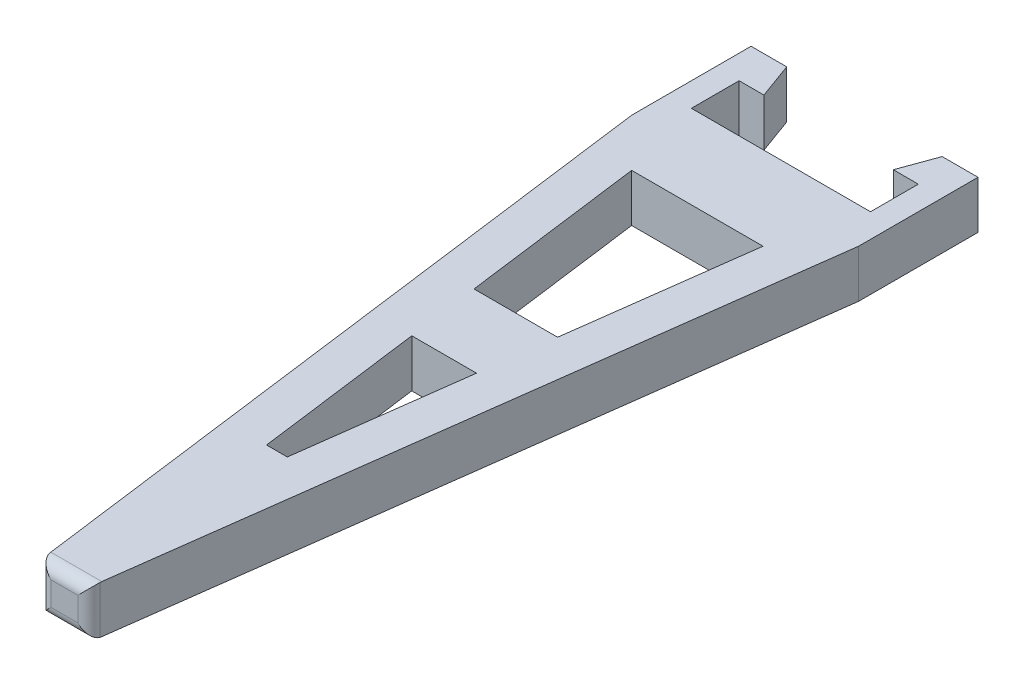
ISO-10303-21;
HEADER;
FILE_DESCRIPTION(('STEP AP214'),'2;1');
FILE_NAME('part.step','',(''),(''),'','','');
FILE_SCHEMA(('AUTOMOTIVE_DESIGN { 1 0 10303 214 1 1 1 1 }'));
ENDSEC;
DATA;
#1=APPLICATION_CONTEXT('core data for automotive mechanical design processes');
#2=APPLICATION_PROTOCOL_DEFINITION('international standard','automotive_design',2000,#1);
#3=PRODUCT_CONTEXT('',#1,'mechanical');
#4=PRODUCT('Part','Part','',(#3));
#5=PRODUCT_RELATED_PRODUCT_CATEGORY('part','',(#4));
#6=PRODUCT_DEFINITION_FORMATION('','',#4);
#7=PRODUCT_DEFINITION_CONTEXT('part definition',#1,'design');
#8=PRODUCT_DEFINITION('design','',#6,#7);
#9=PRODUCT_DEFINITION_SHAPE('','',#8);
#10=(LENGTH_UNIT() NAMED_UNIT(*) SI_UNIT(.MILLI.,.METRE.));
#11=(NAMED_UNIT(*) PLANE_ANGLE_UNIT() SI_UNIT($,.RADIAN.));
#12=(NAMED_UNIT(*) SI_UNIT($,.STERADIAN.) SOLID_ANGLE_UNIT());
#13=UNCERTAINTY_MEASURE_WITH_UNIT(LENGTH_MEASURE(1.E-05),#10,'distance_accuracy_value','');
#14=(GEOMETRIC_REPRESENTATION_CONTEXT(3) GLOBAL_UNCERTAINTY_ASSIGNED_CONTEXT((#13)) GLOBAL_UNIT_ASSIGNED_CONTEXT((#10,
#11,#12)) REPRESENTATION_CONTEXT('',''));
#15=CARTESIAN_POINT('',(0.,0.,0.));
#16=DIRECTION('',(0.,0.,1.));
#17=DIRECTION('',(1.,0.,0.));
#18=AXIS2_PLACEMENT_3D('',#15,#16,#17);
#19=CARTESIAN_POINT('',(0.,4.,0.));
#20=DIRECTION('',(0.,1.,0.));
#21=DIRECTION('',(0.,0.,1.));
#22=AXIS2_PLACEMENT_3D('',#19,#20,#21);
#23=PLANE('',#22);
#24=DIRECTION('',(-1.,0.,0.));
#25=VECTOR('',#24,1.);
#26=CARTESIAN_POINT('',(-3.16599156784221,4.,2.91119108870853));
#27=LINE('',#26,#25);
#28=CARTESIAN_POINT('',(-3.16599156784221,4.,2.91119108870853));
#29=VERTEX_POINT('',#28);
#30=CARTESIAN_POINT('',(-14.1659915678422,4.,2.91119108870852));
#31=VERTEX_POINT('',#30);
#32=EDGE_CURVE('E324',#29,#31,#27,.T.);
#33=ORIENTED_EDGE('',*,*,#32,.F.);
#34=DIRECTION('',(-0.130454512571384,0.,0.991454295542544));
#35=VECTOR('',#34,1.);
#36=CARTESIAN_POINT('',(-3.16599156784221,4.,2.91119108870853));
#37=LINE('',#36,#35);
#38=CARTESIAN_POINT('',(-5.16599156784212,4.,18.1111910887082));
#39=VERTEX_POINT('',#38);
#40=EDGE_CURVE('E310',#29,#39,#37,.T.);
#41=ORIENTED_EDGE('',*,*,#40,.T.);
#42=DIRECTION('',(-1.,0.,0.));
#43=VECTOR('',#42,1.);
#44=CARTESIAN_POINT('',(-5.16599156784212,4.,18.1111910887082));
#45=LINE('',#44,#43);
#46=CARTESIAN_POINT('',(-12.1659915678422,4.,18.1111910887082));
#47=VERTEX_POINT('',#46);
#48=EDGE_CURVE('E318',#39,#47,#45,.T.);
#49=ORIENTED_EDGE('',*,*,#48,.T.);
#50=DIRECTION('',(0.13045451257139,0.,0.991454295542543));
#51=VECTOR('',#50,1.);
#52=CARTESIAN_POINT('',(-14.1659915678422,4.,2.91119108870853));
#53=LINE('',#52,#51);
#54=EDGE_CURVE('E321',#31,#47,#53,.T.);
#55=ORIENTED_EDGE('',*,*,#54,.F.);
#56=EDGE_LOOP('',(#33,#41,#49,#55));
#57=FACE_BOUND('',#56,.T.);
#58=DIRECTION('',(0.13045451257139,0.,0.991454295542543));
#59=VECTOR('',#58,1.);
#60=CARTESIAN_POINT('',(-17.7160096193456,4.,2.33105389728236));
#61=LINE('',#60,#59);
#62=CARTESIAN_POINT('',(-18.1659915678422,4.,-1.08880891129147));
#63=VERTEX_POINT('',#62);
#64=CARTESIAN_POINT('',(-10.7975705152105,4.,54.9111910887085));
#65=VERTEX_POINT('',#64);
#66=EDGE_CURVE('E364',#63,#65,#61,.T.);
#67=ORIENTED_EDGE('',*,*,#66,.T.);
#68=DIRECTION('',(1.,0.,0.));
#69=VECTOR('',#68,1.);
#70=CARTESIAN_POINT('',(-6.66599156784202,4.,54.9111910887085));
#71=LINE('',#70,#69);
#72=CARTESIAN_POINT('',(-6.5344126204736,4.,54.9111910887085));
#73=VERTEX_POINT('',#72);
#74=EDGE_CURVE('E448',#65,#73,#71,.T.);
#75=ORIENTED_EDGE('',*,*,#74,.T.);
#76=DIRECTION('',(0.130454512571384,0.,-0.991454295542544));
#77=VECTOR('',#76,1.);
#78=CARTESIAN_POINT('',(0.678988756222249,4.,0.0893406258187148));
#79=LINE('',#78,#77);
#80=CARTESIAN_POINT('',(0.834008432157797,4.,-1.08880891129147));
#81=VERTEX_POINT('',#80);
#82=EDGE_CURVE('E335',#73,#81,#79,.T.);
#83=ORIENTED_EDGE('',*,*,#82,.T.);
#84=DIRECTION('',(0.,0.,1.));
#85=VECTOR('',#84,1.);
#86=CARTESIAN_POINT('',(0.8340084321578,4.,0.));
#87=LINE('',#86,#85);
#88=CARTESIAN_POINT('',(0.834008432157787,4.,-11.0888089112915));
#89=VERTEX_POINT('',#88);
#90=EDGE_CURVE('E337',#89,#81,#87,.T.);
#91=ORIENTED_EDGE('',*,*,#90,.F.);
#92=DIRECTION('',(1.,0.,0.));
#93=VECTOR('',#92,1.);
#94=CARTESIAN_POINT('',(0.,4.,-11.0888089112915));
#95=LINE('',#94,#93);
#96=CARTESIAN_POINT('',(-2.1659915678422,4.,-11.0888089112915));
#97=VERTEX_POINT('',#96);
#98=EDGE_CURVE('E341',#97,#89,#95,.T.);
#99=ORIENTED_EDGE('',*,*,#98,.F.);
#100=DIRECTION('',(-0.342020143325672,0.,0.939692620785907));
#101=VECTOR('',#100,1.);
#102=CARTESIAN_POINT('',(-2.1659915678422,4.,-11.0888089112915));
#103=LINE('',#102,#101);
#104=CARTESIAN_POINT('',(-3.25790227064081,4.,-8.08880891129147));
#105=VERTEX_POINT('',#104);
#106=EDGE_CURVE('E426',#97,#105,#103,.T.);
#107=ORIENTED_EDGE('',*,*,#106,.T.);
#108=DIRECTION('',(1.,0.,0.));
#109=VECTOR('',#108,1.);
#110=CARTESIAN_POINT('',(0.,4.,-8.08880891129147));
#111=LINE('',#110,#109);
#112=CARTESIAN_POINT('',(-1.16599156784221,4.,-8.08880891129147));
#113=VERTEX_POINT('',#112);
#114=EDGE_CURVE('E344',#105,#113,#111,.T.);
#115=ORIENTED_EDGE('',*,*,#114,.T.);
#116=DIRECTION('',(0.,0.,1.));
#117=VECTOR('',#116,1.);
#118=CARTESIAN_POINT('',(-1.16599156784221,4.,0.));
#119=LINE('',#118,#117);
#120=CARTESIAN_POINT('',(-1.16599156784221,4.,-4.08880891129147));
#121=VERTEX_POINT('',#120);
#122=EDGE_CURVE('E346',#113,#121,#119,.T.);
#123=ORIENTED_EDGE('',*,*,#122,.T.);
#124=DIRECTION('',(1.,0.,0.));
#125=VECTOR('',#124,1.);
#126=CARTESIAN_POINT('',(0.,4.,-4.08880891129147));
#127=LINE('',#126,#125);
#128=CARTESIAN_POINT('',(-16.1659915678422,4.,-4.08880891129147));
#129=VERTEX_POINT('',#128);
#130=EDGE_CURVE('E348',#129,#121,#127,.T.);
#131=ORIENTED_EDGE('',*,*,#130,.F.);
#132=DIRECTION('',(0.,0.,1.));
#133=VECTOR('',#132,1.);
#134=CARTESIAN_POINT('',(-16.1659915678422,4.,0.));
#135=LINE('',#134,#133);
#136=CARTESIAN_POINT('',(-16.1659915678422,4.,-8.08880891129148));
#137=VERTEX_POINT('',#136);
#138=EDGE_CURVE('E351',#137,#129,#135,.T.);
#139=ORIENTED_EDGE('',*,*,#138,.F.);
#140=DIRECTION('',(1.,0.,0.));
#141=VECTOR('',#140,1.);
#142=CARTESIAN_POINT('',(0.,4.,-8.08880891129147));
#143=LINE('',#142,#141);
#144=CARTESIAN_POINT('',(-14.0896605657909,4.,-8.08880891129147));
#145=VERTEX_POINT('',#144);
#146=EDGE_CURVE('E354',#137,#145,#143,.T.);
#147=ORIENTED_EDGE('',*,*,#146,.T.);
#148=DIRECTION('',(0.342020143325666,0.,0.93969262078591));
#149=VECTOR('',#148,1.);
#150=CARTESIAN_POINT('',(-9.84179030117375,4.,3.58211872151701));
#151=LINE('',#150,#149);
#152=CARTESIAN_POINT('',(-15.1815712685895,4.,-11.0888089112915));
#153=VERTEX_POINT('',#152);
#154=EDGE_CURVE('E356',#153,#145,#151,.T.);
#155=ORIENTED_EDGE('',*,*,#154,.F.);
#156=DIRECTION('',(1.,0.,0.));
#157=VECTOR('',#156,1.);
#158=CARTESIAN_POINT('',(0.,4.,-11.0888089112915));
#159=LINE('',#158,#157);
#160=CARTESIAN_POINT('',(-18.1659915678422,4.,-11.0888089112915));
#161=VERTEX_POINT('',#160);
#162=EDGE_CURVE('E359',#161,#153,#159,.T.);
#163=ORIENTED_EDGE('',*,*,#162,.F.);
#164=DIRECTION('',(0.,0.,1.));
#165=VECTOR('',#164,1.);
#166=CARTESIAN_POINT('',(-18.1659915678422,4.,0.));
#167=LINE('',#166,#165);
#168=EDGE_CURVE('E362',#161,#63,#167,.T.);
#169=ORIENTED_EDGE('',*,*,#168,.T.);
#170=EDGE_LOOP('',(#67,#75,#83,#91,#99,#107,#115,#123,#131,#139,#147,#155,#163,#169));
#171=FACE_BOUND('',#170,.T.);
#172=DIRECTION('',(-0.130454512571384,0.,0.991454295542544));
#173=VECTOR('',#172,1.);
#174=CARTESIAN_POINT('',(-2.73557897692958,4.,-0.359944602227568));
#175=LINE('',#174,#173);
#176=CARTESIAN_POINT('',(-5.95546525205263,4.,24.1111910887082));
#177=VERTEX_POINT('',#176);
#178=CARTESIAN_POINT('',(-7.79757051521048,4.,38.1111910887082));
#179=VERTEX_POINT('',#178);
#180=EDGE_CURVE('E287',#177,#179,#175,.T.);
#181=ORIENTED_EDGE('',*,*,#180,.T.);
#182=DIRECTION('',(-1.,0.,0.));
#183=VECTOR('',#182,1.);
#184=CARTESIAN_POINT('',(0.,4.,38.1111910887082));
#185=LINE('',#184,#183);
#186=CARTESIAN_POINT('',(-9.53441262047371,4.,38.1111910887082));
#187=VERTEX_POINT('',#186);
#188=EDGE_CURVE('E280',#179,#187,#185,.T.);
#189=ORIENTED_EDGE('',*,*,#188,.T.);
#190=DIRECTION('',(0.13045451257139,0.,0.991454295542543));
#191=VECTOR('',#190,1.);
#192=CARTESIAN_POINT('',(-14.3014418861938,4.,1.88176866923607));
#193=LINE('',#192,#191);
#194=CARTESIAN_POINT('',(-11.3765178836316,4.,24.1111910887082));
#195=VERTEX_POINT('',#194);
#196=EDGE_CURVE('E281',#195,#187,#193,.T.);
#197=ORIENTED_EDGE('',*,*,#196,.F.);
#198=DIRECTION('',(-1.,0.,0.));
#199=VECTOR('',#198,1.);
#200=CARTESIAN_POINT('',(0.,4.,24.1111910887082));
#201=LINE('',#200,#199);
#202=EDGE_CURVE('E294',#177,#195,#201,.T.);
#203=ORIENTED_EDGE('',*,*,#202,.F.);
#204=EDGE_LOOP('',(#181,#189,#197,#203));
#205=FACE_BOUND('',#204,.T.);
#206=ADVANCED_FACE('F89',(#57,#171,#205),#23,.T.);
#207=CARTESIAN_POINT('',(0.,0.,0.));
#208=DIRECTION('',(0.,1.,0.));
#209=DIRECTION('',(0.,0.,1.));
#210=AXIS2_PLACEMENT_3D('',#207,#208,#209);
#211=PLANE('',#210);
#212=DIRECTION('',(0.130454512571384,0.,-0.991454295542544));
#213=VECTOR('',#212,1.);
#214=CARTESIAN_POINT('',(0.678988756222249,0.,0.0893406258187148));
#215=LINE('',#214,#213);
#216=CARTESIAN_POINT('',(-6.5344126204736,0.,54.9111910887085));
#217=VERTEX_POINT('',#216);
#218=CARTESIAN_POINT('',(0.834008432157797,0.,-1.08880891129147));
#219=VERTEX_POINT('',#218);
#220=EDGE_CURVE('E368',#217,#219,#215,.T.);
#221=ORIENTED_EDGE('',*,*,#220,.F.);
#222=DIRECTION('',(1.,0.,0.));
#223=VECTOR('',#222,1.);
#224=CARTESIAN_POINT('',(0.,0.,54.9111910887085));
#225=LINE('',#224,#223);
#226=CARTESIAN_POINT('',(-10.7975705152105,0.,54.9111910887085));
#227=VERTEX_POINT('',#226);
#228=EDGE_CURVE('E12',#217,#227,#225,.F.);
#229=ORIENTED_EDGE('',*,*,#228,.T.);
#230=DIRECTION('',(0.13045451257139,0.,0.991454295542543));
#231=VECTOR('',#230,1.);
#232=CARTESIAN_POINT('',(-17.7160096193456,0.,2.33105389728236));
#233=LINE('',#232,#231);
#234=CARTESIAN_POINT('',(-18.1659915678422,0.,-1.08880891129147));
#235=VERTEX_POINT('',#234);
#236=EDGE_CURVE('E338',#235,#227,#233,.T.);
#237=ORIENTED_EDGE('',*,*,#236,.F.);
#238=DIRECTION('',(0.,0.,1.));
#239=VECTOR('',#238,1.);
#240=CARTESIAN_POINT('',(-18.1659915678422,0.,0.));
#241=LINE('',#240,#239);
#242=CARTESIAN_POINT('',(-18.1659915678422,0.,-11.0888089112915));
#243=VERTEX_POINT('',#242);
#244=EDGE_CURVE('E397',#243,#235,#241,.T.);
#245=ORIENTED_EDGE('',*,*,#244,.F.);
#246=DIRECTION('',(1.,0.,0.));
#247=VECTOR('',#246,1.);
#248=CARTESIAN_POINT('',(0.,0.,-11.0888089112915));
#249=LINE('',#248,#247);
#250=CARTESIAN_POINT('',(-15.1815712685895,0.,-11.0888089112915));
#251=VERTEX_POINT('',#250);
#252=EDGE_CURVE('E394',#243,#251,#249,.T.);
#253=ORIENTED_EDGE('',*,*,#252,.T.);
#254=DIRECTION('',(0.342020143325666,0.,0.93969262078591));
#255=VECTOR('',#254,1.);
#256=CARTESIAN_POINT('',(-9.84179030117375,0.,3.58211872151701));
#257=LINE('',#256,#255);
#258=CARTESIAN_POINT('',(-14.0896605657909,0.,-8.08880891129147));
#259=VERTEX_POINT('',#258);
#260=EDGE_CURVE('E391',#251,#259,#257,.T.);
#261=ORIENTED_EDGE('',*,*,#260,.T.);
#262=DIRECTION('',(1.,0.,0.));
#263=VECTOR('',#262,1.);
#264=CARTESIAN_POINT('',(0.,0.,-8.08880891129147));
#265=LINE('',#264,#263);
#266=CARTESIAN_POINT('',(-16.1659915678422,0.,-8.08880891129148));
#267=VERTEX_POINT('',#266);
#268=EDGE_CURVE('E388',#267,#259,#265,.T.);
#269=ORIENTED_EDGE('',*,*,#268,.F.);
#270=DIRECTION('',(0.,0.,1.));
#271=VECTOR('',#270,1.);
#272=CARTESIAN_POINT('',(-16.1659915678422,0.,0.));
#273=LINE('',#272,#271);
#274=CARTESIAN_POINT('',(-16.1659915678422,0.,-4.08880891129147));
#275=VERTEX_POINT('',#274);
#276=EDGE_CURVE('E385',#267,#275,#273,.T.);
#277=ORIENTED_EDGE('',*,*,#276,.T.);
#278=DIRECTION('',(1.,0.,0.));
#279=VECTOR('',#278,1.);
#280=CARTESIAN_POINT('',(0.,0.,-4.08880891129147));
#281=LINE('',#280,#279);
#282=CARTESIAN_POINT('',(-1.16599156784221,0.,-4.08880891129147));
#283=VERTEX_POINT('',#282);
#284=EDGE_CURVE('E382',#275,#283,#281,.T.);
#285=ORIENTED_EDGE('',*,*,#284,.T.);
#286=DIRECTION('',(0.,0.,1.));
#287=VECTOR('',#286,1.);
#288=CARTESIAN_POINT('',(-1.16599156784221,0.,0.));
#289=LINE('',#288,#287);
#290=CARTESIAN_POINT('',(-1.16599156784221,0.,-8.08880891129147));
#291=VERTEX_POINT('',#290);
#292=EDGE_CURVE('E379',#291,#283,#289,.T.);
#293=ORIENTED_EDGE('',*,*,#292,.F.);
#294=DIRECTION('',(1.,0.,0.));
#295=VECTOR('',#294,1.);
#296=CARTESIAN_POINT('',(0.,0.,-8.08880891129147));
#297=LINE('',#296,#295);
#298=CARTESIAN_POINT('',(-3.25790227064081,0.,-8.08880891129147));
#299=VERTEX_POINT('',#298);
#300=EDGE_CURVE('E377',#299,#291,#297,.T.);
#301=ORIENTED_EDGE('',*,*,#300,.F.);
#302=DIRECTION('',(-0.342020143325672,0.,0.939692620785907));
#303=VECTOR('',#302,1.);
#304=CARTESIAN_POINT('',(-2.1659915678422,0.,-11.0888089112915));
#305=LINE('',#304,#303);
#306=CARTESIAN_POINT('',(-2.1659915678422,0.,-11.0888089112915));
#307=VERTEX_POINT('',#306);
#308=EDGE_CURVE('E272',#307,#299,#305,.T.);
#309=ORIENTED_EDGE('',*,*,#308,.F.);
#310=DIRECTION('',(1.,0.,0.));
#311=VECTOR('',#310,1.);
#312=CARTESIAN_POINT('',(0.,0.,-11.0888089112915));
#313=LINE('',#312,#311);
#314=CARTESIAN_POINT('',(0.834008432157787,0.,-11.0888089112915));
#315=VERTEX_POINT('',#314);
#316=EDGE_CURVE('E374',#307,#315,#313,.T.);
#317=ORIENTED_EDGE('',*,*,#316,.T.);
#318=DIRECTION('',(0.,0.,1.));
#319=VECTOR('',#318,1.);
#320=CARTESIAN_POINT('',(0.8340084321578,0.,0.));
#321=LINE('',#320,#319);
#322=EDGE_CURVE('E370',#315,#219,#321,.T.);
#323=ORIENTED_EDGE('',*,*,#322,.T.);
#324=EDGE_LOOP('',(#221,#229,#237,#245,#253,#261,#269,#277,#285,#293,#301,#309,#317,#323));
#325=FACE_BOUND('',#324,.T.);
#326=DIRECTION('',(0.130454512571384,0.,-0.991454295542544));
#327=VECTOR('',#326,1.);
#328=CARTESIAN_POINT('',(-3.16599156784221,0.,2.91119108870853));
#329=LINE('',#328,#327);
#330=CARTESIAN_POINT('',(-5.16599156784212,0.,18.1111910887082));
#331=VERTEX_POINT('',#330);
#332=CARTESIAN_POINT('',(-3.16599156784221,0.,2.91119108870853));
#333=VERTEX_POINT('',#332);
#334=EDGE_CURVE('E329',#331,#333,#329,.T.);
#335=ORIENTED_EDGE('',*,*,#334,.T.);
#336=DIRECTION('',(1.,0.,0.));
#337=VECTOR('',#336,1.);
#338=CARTESIAN_POINT('',(-3.16599156784221,0.,2.91119108870853));
#339=LINE('',#338,#337);
#340=CARTESIAN_POINT('',(-14.1659915678422,0.,2.91119108870853));
#341=VERTEX_POINT('',#340);
#342=EDGE_CURVE('E326',#341,#333,#339,.T.);
#343=ORIENTED_EDGE('',*,*,#342,.F.);
#344=DIRECTION('',(-0.13045451257139,0.,-0.991454295542543));
#345=VECTOR('',#344,1.);
#346=CARTESIAN_POINT('',(-14.1659915678422,0.,2.91119108870853));
#347=LINE('',#346,#345);
#348=CARTESIAN_POINT('',(-12.1659915678422,0.,18.1111910887082));
#349=VERTEX_POINT('',#348);
#350=EDGE_CURVE('E303',#349,#341,#347,.T.);
#351=ORIENTED_EDGE('',*,*,#350,.F.);
#352=DIRECTION('',(1.,0.,0.));
#353=VECTOR('',#352,1.);
#354=CARTESIAN_POINT('',(-5.16599156784212,0.,18.1111910887082));
#355=LINE('',#354,#353);
#356=EDGE_CURVE('E332',#349,#331,#355,.T.);
#357=ORIENTED_EDGE('',*,*,#356,.T.);
#358=EDGE_LOOP('',(#335,#343,#351,#357));
#359=FACE_BOUND('',#358,.T.);
#360=DIRECTION('',(1.,0.,0.));
#361=VECTOR('',#360,1.);
#362=CARTESIAN_POINT('',(0.,0.,38.1111910887082));
#363=LINE('',#362,#361);
#364=CARTESIAN_POINT('',(-9.53441262047371,0.,38.1111910887082));
#365=VERTEX_POINT('',#364);
#366=CARTESIAN_POINT('',(-7.79757051521048,0.,38.1111910887082));
#367=VERTEX_POINT('',#366);
#368=EDGE_CURVE('E277',#365,#367,#363,.T.);
#369=ORIENTED_EDGE('',*,*,#368,.T.);
#370=DIRECTION('',(0.130454512571384,0.,-0.991454295542544));
#371=VECTOR('',#370,1.);
#372=CARTESIAN_POINT('',(-2.73557897692958,0.,-0.359944602227568));
#373=LINE('',#372,#371);
#374=CARTESIAN_POINT('',(-5.95546525205263,0.,24.1111910887082));
#375=VERTEX_POINT('',#374);
#376=EDGE_CURVE('E261',#367,#375,#373,.T.);
#377=ORIENTED_EDGE('',*,*,#376,.T.);
#378=DIRECTION('',(1.,0.,0.));
#379=VECTOR('',#378,1.);
#380=CARTESIAN_POINT('',(0.,0.,24.1111910887082));
#381=LINE('',#380,#379);
#382=CARTESIAN_POINT('',(-11.3765178836316,0.,24.1111910887082));
#383=VERTEX_POINT('',#382);
#384=EDGE_CURVE('E289',#383,#375,#381,.T.);
#385=ORIENTED_EDGE('',*,*,#384,.F.);
#386=DIRECTION('',(-0.13045451257139,0.,-0.991454295542543));
#387=VECTOR('',#386,1.);
#388=CARTESIAN_POINT('',(-14.3014418861938,0.,1.88176866923607));
#389=LINE('',#388,#387);
#390=EDGE_CURVE('E285',#365,#383,#389,.T.);
#391=ORIENTED_EDGE('',*,*,#390,.F.);
#392=EDGE_LOOP('',(#369,#377,#385,#391));
#393=FACE_BOUND('',#392,.T.);
#394=ADVANCED_FACE('F284',(#325,#359,#393),#211,.F.);
#395=CARTESIAN_POINT('',(0.,4.,55.9111910887085));
#396=DIRECTION('',(0.,0.,-1.));
#397=DIRECTION('',(-1.,0.,0.));
#398=AXIS2_PLACEMENT_3D('',#395,#396,#397);
#399=PLANE('',#398);
#400=DIRECTION('',(1.,0.,0.));
#401=VECTOR('',#400,1.);
#402=CARTESIAN_POINT('',(-10.665991567842,3.,55.9111910887085));
#403=LINE('',#402,#401);
#404=CARTESIAN_POINT('',(-7.54303198345975,3.,55.9111910887085));
#405=VERTEX_POINT('',#404);
#406=CARTESIAN_POINT('',(-9.7889511522243,3.,55.9111910887085));
#407=VERTEX_POINT('',#406);
#408=EDGE_CURVE('E436',#405,#407,#403,.F.);
#409=ORIENTED_EDGE('',*,*,#408,.T.);
#410=DIRECTION('',(0.,-1.,0.));
#411=VECTOR('',#410,1.);
#412=CARTESIAN_POINT('',(-9.7889511522243,4.,55.9111910887085));
#413=LINE('',#412,#411);
#414=CARTESIAN_POINT('',(-9.7889511522243,1.,55.9111910887085));
#415=VERTEX_POINT('',#414);
#416=EDGE_CURVE('E438',#407,#415,#413,.T.);
#417=ORIENTED_EDGE('',*,*,#416,.T.);
#418=DIRECTION('',(1.,0.,0.));
#419=VECTOR('',#418,1.);
#420=CARTESIAN_POINT('',(0.,1.,55.9111910887085));
#421=LINE('',#420,#419);
#422=CARTESIAN_POINT('',(-7.54303198345975,1.,55.9111910887085));
#423=VERTEX_POINT('',#422);
#424=EDGE_CURVE('E425',#415,#423,#421,.T.);
#425=ORIENTED_EDGE('',*,*,#424,.T.);
#426=DIRECTION('',(0.,-1.,0.));
#427=VECTOR('',#426,1.);
#428=CARTESIAN_POINT('',(-7.54303198345975,4.,55.9111910887085));
#429=LINE('',#428,#427);
#430=EDGE_CURVE('E434',#423,#405,#429,.F.);
#431=ORIENTED_EDGE('',*,*,#430,.T.);
#432=EDGE_LOOP('',(#409,#417,#425,#431));
#433=FACE_BOUND('',#432,.T.);
#434=ADVANCED_FACE('F499',(#433),#399,.F.);
#435=CARTESIAN_POINT('',(0.678988756222249,4.,0.0893406258187148));
#436=DIRECTION('',(-0.991454295542544,0.,-0.130454512571384));
#437=DIRECTION('',(-0.130454512571384,0.,0.991454295542544));
#438=AXIS2_PLACEMENT_3D('',#435,#436,#437);
#439=PLANE('',#438);
#440=ORIENTED_EDGE('',*,*,#82,.F.);
#441=CARTESIAN_POINT('',(-6.5344126204736,3.,54.9111910887085));
#442=DIRECTION('',(-0.991454295542544,0.,-0.130454512571384));
#443=DIRECTION('',(-0.130454512571384,0.,0.991454295542544));
#444=AXIS2_PLACEMENT_3D('',#441,#442,#443);
#445=ELLIPSE('',#444,1.00861936298615,1.);
#446=CARTESIAN_POINT('',(-6.5515776879172,3.99145429554255,55.0416456012799));
#447=VERTEX_POINT('',#446);
#448=EDGE_CURVE('E98',#73,#447,#445,.F.);
#449=ORIENTED_EDGE('',*,*,#448,.T.);
#450=DIRECTION('',(0.,-1.,0.));
#451=VECTOR('',#450,1.);
#452=CARTESIAN_POINT('',(-6.5515776879172,4.,55.0416456012799));
#453=LINE('',#452,#451);
#454=CARTESIAN_POINT('',(-6.5515776879172,0.008545704457452,55.0416456012799));
#455=VERTEX_POINT('',#454);
#456=EDGE_CURVE('E109',#447,#455,#453,.T.);
#457=ORIENTED_EDGE('',*,*,#456,.T.);
#458=CARTESIAN_POINT('',(-6.5344126204736,1.,54.9111910887085));
#459=DIRECTION('',(-0.991454295542544,0.,-0.130454512571384));
#460=DIRECTION('',(0.130454512571384,0.,-0.991454295542544));
#461=AXIS2_PLACEMENT_3D('',#458,#459,#460);
#462=ELLIPSE('',#461,1.00861936298615,1.);
#463=EDGE_CURVE('E450',#455,#217,#462,.F.);
#464=ORIENTED_EDGE('',*,*,#463,.T.);
#465=ORIENTED_EDGE('',*,*,#220,.T.);
#466=DIRECTION('',(0.,-1.,0.));
#467=VECTOR('',#466,1.);
#468=CARTESIAN_POINT('',(0.834008432157797,4.,-1.08880891129147));
#469=LINE('',#468,#467);
#470=EDGE_CURVE('E422',#81,#219,#469,.T.);
#471=ORIENTED_EDGE('',*,*,#470,.F.);
#472=EDGE_LOOP('',(#440,#449,#457,#464,#465,#471));
#473=FACE_BOUND('',#472,.T.);
#474=ADVANCED_FACE('F475',(#473),#439,.F.);
#475=CARTESIAN_POINT('',(0.8340084321578,4.,0.));
#476=DIRECTION('',(1.,0.,0.));
#477=DIRECTION('',(0.,0.,-1.));
#478=AXIS2_PLACEMENT_3D('',#475,#476,#477);
#479=PLANE('',#478);
#480=ORIENTED_EDGE('',*,*,#322,.F.);
#481=DIRECTION('',(0.,-1.,0.));
#482=VECTOR('',#481,1.);
#483=CARTESIAN_POINT('',(0.834008432157787,4.,-11.0888089112915));
#484=LINE('',#483,#482);
#485=EDGE_CURVE('E420',#89,#315,#484,.T.);
#486=ORIENTED_EDGE('',*,*,#485,.F.);
#487=ORIENTED_EDGE('',*,*,#90,.T.);
#488=ORIENTED_EDGE('',*,*,#470,.T.);
#489=EDGE_LOOP('',(#480,#486,#487,#488));
#490=FACE_BOUND('',#489,.T.);
#491=ADVANCED_FACE('F484',(#490),#479,.T.);
#492=CARTESIAN_POINT('',(0.,4.,-11.0888089112915));
#493=DIRECTION('',(0.,0.,-1.));
#494=DIRECTION('',(-1.,0.,0.));
#495=AXIS2_PLACEMENT_3D('',#492,#493,#494);
#496=PLANE('',#495);
#497=ORIENTED_EDGE('',*,*,#316,.F.);
#498=DIRECTION('',(0.,-1.,0.));
#499=VECTOR('',#498,1.);
#500=CARTESIAN_POINT('',(-2.1659915678422,4.,-11.0888089112915));
#501=LINE('',#500,#499);
#502=EDGE_CURVE('E418',#97,#307,#501,.T.);
#503=ORIENTED_EDGE('',*,*,#502,.F.);
#504=ORIENTED_EDGE('',*,*,#98,.T.);
#505=ORIENTED_EDGE('',*,*,#485,.T.);
#506=EDGE_LOOP('',(#497,#503,#504,#505));
#507=FACE_BOUND('',#506,.T.);
#508=ADVANCED_FACE('F556',(#507),#496,.T.);
#509=CARTESIAN_POINT('',(0.,4.,-8.08880891129147));
#510=DIRECTION('',(0.,0.,-1.));
#511=DIRECTION('',(-1.,0.,0.));
#512=AXIS2_PLACEMENT_3D('',#509,#510,#511);
#513=PLANE('',#512);
#514=ORIENTED_EDGE('',*,*,#300,.T.);
#515=DIRECTION('',(0.,-1.,0.));
#516=VECTOR('',#515,1.);
#517=CARTESIAN_POINT('',(-1.16599156784221,4.,-8.08880891129147));
#518=LINE('',#517,#516);
#519=EDGE_CURVE('E415',#113,#291,#518,.T.);
#520=ORIENTED_EDGE('',*,*,#519,.F.);
#521=ORIENTED_EDGE('',*,*,#114,.F.);
#522=DIRECTION('',(0.,-1.,0.));
#523=VECTOR('',#522,1.);
#524=CARTESIAN_POINT('',(-3.25790227064081,4.,-8.08880891129147));
#525=LINE('',#524,#523);
#526=EDGE_CURVE('E371',#105,#299,#525,.T.);
#527=ORIENTED_EDGE('',*,*,#526,.T.);
#528=EDGE_LOOP('',(#514,#520,#521,#527));
#529=FACE_BOUND('',#528,.T.);
#530=ADVANCED_FACE('F552',(#529),#513,.F.);
#531=CARTESIAN_POINT('',(-1.16599156784221,4.,0.));
#532=DIRECTION('',(1.,0.,0.));
#533=DIRECTION('',(0.,0.,-1.));
#534=AXIS2_PLACEMENT_3D('',#531,#532,#533);
#535=PLANE('',#534);
#536=ORIENTED_EDGE('',*,*,#292,.T.);
#537=DIRECTION('',(0.,-1.,0.));
#538=VECTOR('',#537,1.);
#539=CARTESIAN_POINT('',(-1.16599156784221,4.,-4.08880891129147));
#540=LINE('',#539,#538);
#541=EDGE_CURVE('E413',#121,#283,#540,.T.);
#542=ORIENTED_EDGE('',*,*,#541,.F.);
#543=ORIENTED_EDGE('',*,*,#122,.F.);
#544=ORIENTED_EDGE('',*,*,#519,.T.);
#545=EDGE_LOOP('',(#536,#542,#543,#544));
#546=FACE_BOUND('',#545,.T.);
#547=ADVANCED_FACE('F548',(#546),#535,.F.);
#548=CARTESIAN_POINT('',(0.,4.,-4.08880891129147));
#549=DIRECTION('',(0.,0.,-1.));
#550=DIRECTION('',(-1.,0.,0.));
#551=AXIS2_PLACEMENT_3D('',#548,#549,#550);
#552=PLANE('',#551);
#553=ORIENTED_EDGE('',*,*,#284,.F.);
#554=DIRECTION('',(0.,-1.,0.));
#555=VECTOR('',#554,1.);
#556=CARTESIAN_POINT('',(-16.1659915678422,4.,-4.08880891129147));
#557=LINE('',#556,#555);
#558=EDGE_CURVE('E411',#129,#275,#557,.T.);
#559=ORIENTED_EDGE('',*,*,#558,.F.);
#560=ORIENTED_EDGE('',*,*,#130,.T.);
#561=ORIENTED_EDGE('',*,*,#541,.T.);
#562=EDGE_LOOP('',(#553,#559,#560,#561));
#563=FACE_BOUND('',#562,.T.);
#564=ADVANCED_FACE('F544',(#563),#552,.T.);
#565=CARTESIAN_POINT('',(-16.1659915678422,4.,0.));
#566=DIRECTION('',(1.,0.,0.));
#567=DIRECTION('',(0.,0.,-1.));
#568=AXIS2_PLACEMENT_3D('',#565,#566,#567);
#569=PLANE('',#568);
#570=ORIENTED_EDGE('',*,*,#276,.F.);
#571=DIRECTION('',(0.,-1.,0.));
#572=VECTOR('',#571,1.);
#573=CARTESIAN_POINT('',(-16.1659915678422,4.,-8.08880891129148));
#574=LINE('',#573,#572);
#575=EDGE_CURVE('E409',#137,#267,#574,.T.);
#576=ORIENTED_EDGE('',*,*,#575,.F.);
#577=ORIENTED_EDGE('',*,*,#138,.T.);
#578=ORIENTED_EDGE('',*,*,#558,.T.);
#579=EDGE_LOOP('',(#570,#576,#577,#578));
#580=FACE_BOUND('',#579,.T.);
#581=ADVANCED_FACE('F540',(#580),#569,.T.);
#582=CARTESIAN_POINT('',(0.,4.,-8.08880891129147));
#583=DIRECTION('',(0.,0.,-1.));
#584=DIRECTION('',(-1.,0.,0.));
#585=AXIS2_PLACEMENT_3D('',#582,#583,#584);
#586=PLANE('',#585);
#587=ORIENTED_EDGE('',*,*,#268,.T.);
#588=DIRECTION('',(0.,-1.,0.));
#589=VECTOR('',#588,1.);
#590=CARTESIAN_POINT('',(-14.0896605657909,4.,-8.08880891129147));
#591=LINE('',#590,#589);
#592=EDGE_CURVE('E407',#145,#259,#591,.T.);
#593=ORIENTED_EDGE('',*,*,#592,.F.);
#594=ORIENTED_EDGE('',*,*,#146,.F.);
#595=ORIENTED_EDGE('',*,*,#575,.T.);
#596=EDGE_LOOP('',(#587,#593,#594,#595));
#597=FACE_BOUND('',#596,.T.);
#598=ADVANCED_FACE('F536',(#597),#586,.F.);
#599=CARTESIAN_POINT('',(-9.84179030117375,4.,3.58211872151701));
#600=DIRECTION('',(0.93969262078591,0.,-0.342020143325666));
#601=DIRECTION('',(-0.342020143325666,0.,-0.93969262078591));
#602=AXIS2_PLACEMENT_3D('',#599,#600,#601);
#603=PLANE('',#602);
#604=ORIENTED_EDGE('',*,*,#260,.F.);
#605=DIRECTION('',(0.,-1.,0.));
#606=VECTOR('',#605,1.);
#607=CARTESIAN_POINT('',(-15.1815712685895,4.,-11.0888089112915));
#608=LINE('',#607,#606);
#609=EDGE_CURVE('E405',#153,#251,#608,.T.);
#610=ORIENTED_EDGE('',*,*,#609,.F.);
#611=ORIENTED_EDGE('',*,*,#154,.T.);
#612=ORIENTED_EDGE('',*,*,#592,.T.);
#613=EDGE_LOOP('',(#604,#610,#611,#612));
#614=FACE_BOUND('',#613,.T.);
#615=ADVANCED_FACE('F532',(#614),#603,.T.);
#616=CARTESIAN_POINT('',(0.,4.,-11.0888089112915));
#617=DIRECTION('',(0.,0.,-1.));
#618=DIRECTION('',(-1.,0.,0.));
#619=AXIS2_PLACEMENT_3D('',#616,#617,#618);
#620=PLANE('',#619);
#621=ORIENTED_EDGE('',*,*,#252,.F.);
#622=DIRECTION('',(0.,-1.,0.));
#623=VECTOR('',#622,1.);
#624=CARTESIAN_POINT('',(-18.1659915678422,4.,-11.0888089112915));
#625=LINE('',#624,#623);
#626=EDGE_CURVE('E403',#161,#243,#625,.T.);
#627=ORIENTED_EDGE('',*,*,#626,.F.);
#628=ORIENTED_EDGE('',*,*,#162,.T.);
#629=ORIENTED_EDGE('',*,*,#609,.T.);
#630=EDGE_LOOP('',(#621,#627,#628,#629));
#631=FACE_BOUND('',#630,.T.);
#632=ADVANCED_FACE('F528',(#631),#620,.T.);
#633=CARTESIAN_POINT('',(-18.1659915678422,4.,0.));
#634=DIRECTION('',(1.,0.,0.));
#635=DIRECTION('',(0.,0.,-1.));
#636=AXIS2_PLACEMENT_3D('',#633,#634,#635);
#637=PLANE('',#636);
#638=ORIENTED_EDGE('',*,*,#244,.T.);
#639=DIRECTION('',(0.,-1.,0.));
#640=VECTOR('',#639,1.);
#641=CARTESIAN_POINT('',(-18.1659915678422,4.,-1.08880891129147));
#642=LINE('',#641,#640);
#643=EDGE_CURVE('E367',#63,#235,#642,.T.);
#644=ORIENTED_EDGE('',*,*,#643,.F.);
#645=ORIENTED_EDGE('',*,*,#168,.F.);
#646=ORIENTED_EDGE('',*,*,#626,.T.);
#647=EDGE_LOOP('',(#638,#644,#645,#646));
#648=FACE_BOUND('',#647,.T.);
#649=ADVANCED_FACE('F525',(#648),#637,.F.);
#650=CARTESIAN_POINT('',(-17.7160096193456,4.,2.33105389728236));
#651=DIRECTION('',(0.991454295542543,0.,-0.13045451257139));
#652=DIRECTION('',(-0.13045451257139,0.,-0.991454295542543));
#653=AXIS2_PLACEMENT_3D('',#650,#651,#652);
#654=PLANE('',#653);
#655=DIRECTION('',(0.,-1.,0.));
#656=VECTOR('',#655,1.);
#657=CARTESIAN_POINT('',(-10.7804054477668,4.,55.0416456012799));
#658=LINE('',#657,#656);
#659=CARTESIAN_POINT('',(-10.7804054477668,0.00854570445745374,55.0416456012799));
#660=VERTEX_POINT('',#659);
#661=CARTESIAN_POINT('',(-10.7804054477668,3.99145429554255,55.0416456012799));
#662=VERTEX_POINT('',#661);
#663=EDGE_CURVE('E443',#660,#662,#658,.F.);
#664=ORIENTED_EDGE('',*,*,#663,.T.);
#665=CARTESIAN_POINT('',(-10.7975705152105,3.,54.9111910887085));
#666=DIRECTION('',(0.991454295542543,0.,-0.13045451257139));
#667=DIRECTION('',(-0.13045451257139,0.,-0.991454295542543));
#668=AXIS2_PLACEMENT_3D('',#665,#666,#667);
#669=ELLIPSE('',#668,1.00861936298615,1.);
#670=EDGE_CURVE('E446',#662,#65,#669,.F.);
#671=ORIENTED_EDGE('',*,*,#670,.T.);
#672=ORIENTED_EDGE('',*,*,#66,.F.);
#673=ORIENTED_EDGE('',*,*,#643,.T.);
#674=ORIENTED_EDGE('',*,*,#236,.T.);
#675=CARTESIAN_POINT('',(-10.7975705152105,1.,54.9111910887085));
#676=DIRECTION('',(0.991454295542543,0.,-0.13045451257139));
#677=DIRECTION('',(0.13045451257139,0.,0.991454295542543));
#678=AXIS2_PLACEMENT_3D('',#675,#676,#677);
#679=ELLIPSE('',#678,1.00861936298615,1.);
#680=EDGE_CURVE('E441',#227,#660,#679,.F.);
#681=ORIENTED_EDGE('',*,*,#680,.T.);
#682=EDGE_LOOP('',(#664,#671,#672,#673,#674,#681));
#683=FACE_BOUND('',#682,.T.);
#684=ADVANCED_FACE('F494',(#683),#654,.F.);
#685=CARTESIAN_POINT('',(-2.1659915678422,4.,-11.0888089112915));
#686=DIRECTION('',(0.939692620785907,0.,0.342020143325672));
#687=DIRECTION('',(0.342020143325672,0.,-0.939692620785907));
#688=AXIS2_PLACEMENT_3D('',#685,#686,#687);
#689=PLANE('',#688);
#690=ORIENTED_EDGE('',*,*,#308,.T.);
#691=ORIENTED_EDGE('',*,*,#526,.F.);
#692=ORIENTED_EDGE('',*,*,#106,.F.);
#693=ORIENTED_EDGE('',*,*,#502,.T.);
#694=EDGE_LOOP('',(#690,#691,#692,#693));
#695=FACE_BOUND('',#694,.T.);
#696=ADVANCED_FACE('F502',(#695),#689,.F.);
#697=CARTESIAN_POINT('',(-3.16599156784221,-0.00100000000000013,2.91119108870853));
#698=DIRECTION('',(0.,0.,-1.));
#699=DIRECTION('',(-1.,0.,0.));
#700=AXIS2_PLACEMENT_3D('',#697,#698,#699);
#701=PLANE('',#700);
#702=ORIENTED_EDGE('',*,*,#342,.T.);
#703=DIRECTION('',(0.,1.,0.));
#704=VECTOR('',#703,1.);
#705=CARTESIAN_POINT('',(-3.16599156784221,-0.00100000000000013,2.91119108870853));
#706=LINE('',#705,#704);
#707=EDGE_CURVE('E306',#333,#29,#706,.T.);
#708=ORIENTED_EDGE('',*,*,#707,.T.);
#709=ORIENTED_EDGE('',*,*,#32,.T.);
#710=DIRECTION('',(0.,1.,0.));
#711=VECTOR('',#710,1.);
#712=CARTESIAN_POINT('',(-14.1659915678422,-0.00100000000000013,2.91119108870853));
#713=LINE('',#712,#711);
#714=EDGE_CURVE('E307',#341,#31,#713,.T.);
#715=ORIENTED_EDGE('',*,*,#714,.F.);
#716=EDGE_LOOP('',(#702,#708,#709,#715));
#717=FACE_BOUND('',#716,.T.);
#718=ADVANCED_FACE('F511',(#717),#701,.F.);
#719=CARTESIAN_POINT('',(-3.16599156784221,-0.00100000000000013,2.91119108870853));
#720=DIRECTION('',(-0.991454295542544,0.,-0.130454512571384));
#721=DIRECTION('',(-0.130454512571384,0.,0.991454295542544));
#722=AXIS2_PLACEMENT_3D('',#719,#720,#721);
#723=PLANE('',#722);
#724=DIRECTION('',(0.,1.,0.));
#725=VECTOR('',#724,1.);
#726=CARTESIAN_POINT('',(-5.16599156784212,-0.00100000000000013,18.1111910887082));
#727=LINE('',#726,#725);
#728=EDGE_CURVE('E313',#331,#39,#727,.T.);
#729=ORIENTED_EDGE('',*,*,#728,.T.);
#730=ORIENTED_EDGE('',*,*,#40,.F.);
#731=ORIENTED_EDGE('',*,*,#707,.F.);
#732=ORIENTED_EDGE('',*,*,#334,.F.);
#733=EDGE_LOOP('',(#729,#730,#731,#732));
#734=FACE_BOUND('',#733,.T.);
#735=ADVANCED_FACE('F520',(#734),#723,.T.);
#736=CARTESIAN_POINT('',(-5.16599156784212,-0.00100000000000013,18.1111910887082));
#737=DIRECTION('',(0.,0.,-1.));
#738=DIRECTION('',(-1.,0.,0.));
#739=AXIS2_PLACEMENT_3D('',#736,#737,#738);
#740=PLANE('',#739);
#741=DIRECTION('',(0.,1.,0.));
#742=VECTOR('',#741,1.);
#743=CARTESIAN_POINT('',(-12.1659915678422,-0.00100000000000013,18.1111910887082));
#744=LINE('',#743,#742);
#745=EDGE_CURVE('E311',#349,#47,#744,.T.);
#746=ORIENTED_EDGE('',*,*,#745,.T.);
#747=ORIENTED_EDGE('',*,*,#48,.F.);
#748=ORIENTED_EDGE('',*,*,#728,.F.);
#749=ORIENTED_EDGE('',*,*,#356,.F.);
#750=EDGE_LOOP('',(#746,#747,#748,#749));
#751=FACE_BOUND('',#750,.T.);
#752=ADVANCED_FACE('F624',(#751),#740,.T.);
#753=CARTESIAN_POINT('',(-14.1659915678422,-0.00100000000000013,2.91119108870853));
#754=DIRECTION('',(-0.991454295542543,0.,0.13045451257139));
#755=DIRECTION('',(0.13045451257139,0.,0.991454295542543));
#756=AXIS2_PLACEMENT_3D('',#753,#754,#755);
#757=PLANE('',#756);
#758=ORIENTED_EDGE('',*,*,#350,.T.);
#759=ORIENTED_EDGE('',*,*,#714,.T.);
#760=ORIENTED_EDGE('',*,*,#54,.T.);
#761=ORIENTED_EDGE('',*,*,#745,.F.);
#762=EDGE_LOOP('',(#758,#759,#760,#761));
#763=FACE_BOUND('',#762,.T.);
#764=ADVANCED_FACE('F631',(#763),#757,.F.);
#765=CARTESIAN_POINT('',(0.,-0.00100000000000013,38.1111910887082));
#766=DIRECTION('',(0.,0.,-1.));
#767=DIRECTION('',(-1.,0.,0.));
#768=AXIS2_PLACEMENT_3D('',#765,#766,#767);
#769=PLANE('',#768);
#770=DIRECTION('',(0.,1.,0.));
#771=VECTOR('',#770,1.);
#772=CARTESIAN_POINT('',(-9.53441262047371,-0.00100000000000013,38.1111910887082));
#773=LINE('',#772,#771);
#774=EDGE_CURVE('E273',#365,#187,#773,.T.);
#775=ORIENTED_EDGE('',*,*,#774,.T.);
#776=ORIENTED_EDGE('',*,*,#188,.F.);
#777=DIRECTION('',(0.,1.,0.));
#778=VECTOR('',#777,1.);
#779=CARTESIAN_POINT('',(-7.79757051521048,-0.00100000000000013,38.1111910887082));
#780=LINE('',#779,#778);
#781=EDGE_CURVE('E265',#367,#179,#780,.T.);
#782=ORIENTED_EDGE('',*,*,#781,.F.);
#783=ORIENTED_EDGE('',*,*,#368,.F.);
#784=EDGE_LOOP('',(#775,#776,#782,#783));
#785=FACE_BOUND('',#784,.T.);
#786=ADVANCED_FACE('F276',(#785),#769,.T.);
#787=CARTESIAN_POINT('',(-14.3014418861938,-0.00100000000000013,1.88176866923607));
#788=DIRECTION('',(-0.991454295542543,0.,0.13045451257139));
#789=DIRECTION('',(0.13045451257139,0.,0.991454295542543));
#790=AXIS2_PLACEMENT_3D('',#787,#788,#789);
#791=PLANE('',#790);
#792=ORIENTED_EDGE('',*,*,#390,.T.);
#793=DIRECTION('',(0.,1.,0.));
#794=VECTOR('',#793,1.);
#795=CARTESIAN_POINT('',(-11.3765178836316,-0.00100000000000013,24.1111910887082));
#796=LINE('',#795,#794);
#797=EDGE_CURVE('E300',#383,#195,#796,.T.);
#798=ORIENTED_EDGE('',*,*,#797,.T.);
#799=ORIENTED_EDGE('',*,*,#196,.T.);
#800=ORIENTED_EDGE('',*,*,#774,.F.);
#801=EDGE_LOOP('',(#792,#798,#799,#800));
#802=FACE_BOUND('',#801,.T.);
#803=ADVANCED_FACE('F645',(#802),#791,.F.);
#804=CARTESIAN_POINT('',(0.,-0.00100000000000013,24.1111910887082));
#805=DIRECTION('',(0.,0.,-1.));
#806=DIRECTION('',(-1.,0.,0.));
#807=AXIS2_PLACEMENT_3D('',#804,#805,#806);
#808=PLANE('',#807);
#809=ORIENTED_EDGE('',*,*,#384,.T.);
#810=DIRECTION('',(0.,1.,0.));
#811=VECTOR('',#810,1.);
#812=CARTESIAN_POINT('',(-5.95546525205263,-0.00100000000000013,24.1111910887082));
#813=LINE('',#812,#811);
#814=EDGE_CURVE('E267',#375,#177,#813,.T.);
#815=ORIENTED_EDGE('',*,*,#814,.T.);
#816=ORIENTED_EDGE('',*,*,#202,.T.);
#817=ORIENTED_EDGE('',*,*,#797,.F.);
#818=EDGE_LOOP('',(#809,#815,#816,#817));
#819=FACE_BOUND('',#818,.T.);
#820=ADVANCED_FACE('F652',(#819),#808,.F.);
#821=CARTESIAN_POINT('',(-2.73557897692958,-0.00100000000000013,-0.359944602227568));
#822=DIRECTION('',(-0.991454295542544,0.,-0.130454512571384));
#823=DIRECTION('',(-0.130454512571384,0.,0.991454295542544));
#824=AXIS2_PLACEMENT_3D('',#821,#822,#823);
#825=PLANE('',#824);
#826=ORIENTED_EDGE('',*,*,#781,.T.);
#827=ORIENTED_EDGE('',*,*,#180,.F.);
#828=ORIENTED_EDGE('',*,*,#814,.F.);
#829=ORIENTED_EDGE('',*,*,#376,.F.);
#830=EDGE_LOOP('',(#826,#827,#828,#829));
#831=FACE_BOUND('',#830,.T.);
#832=ADVANCED_FACE('F263',(#831),#825,.T.);
#833=CARTESIAN_POINT('',(-7.54303198345975,4.,54.9111910887085));
#834=DIRECTION('',(0.,-1.,0.));
#835=DIRECTION('',(0.,0.,-1.));
#836=AXIS2_PLACEMENT_3D('',#833,#834,#835);
#837=CYLINDRICAL_SURFACE('',#836,1.);
#838=CARTESIAN_POINT('',(-7.54303198345975,1.,54.9111910887085));
#839=DIRECTION('',(0.707106781186547,0.707106781186547,0.));
#840=DIRECTION('',(0.707106781186547,-0.707106781186547,0.));
#841=AXIS2_PLACEMENT_3D('',#838,#839,#840);
#842=ELLIPSE('',#841,1.41421356237309,1.);
#843=EDGE_CURVE('E457',#455,#423,#842,.F.);
#844=ORIENTED_EDGE('',*,*,#843,.F.);
#845=ORIENTED_EDGE('',*,*,#456,.F.);
#846=CARTESIAN_POINT('',(-7.54303198345975,3.,54.9111910887085));
#847=DIRECTION('',(0.707106781186547,-0.707106781186547,0.));
#848=DIRECTION('',(-0.707106781186547,-0.707106781186547,0.));
#849=AXIS2_PLACEMENT_3D('',#846,#847,#848);
#850=ELLIPSE('',#849,1.41421356237309,1.);
#851=EDGE_CURVE('E93',#405,#447,#850,.F.);
#852=ORIENTED_EDGE('',*,*,#851,.F.);
#853=ORIENTED_EDGE('',*,*,#430,.F.);
#854=EDGE_LOOP('',(#844,#845,#852,#853));
#855=FACE_BOUND('',#854,.T.);
#856=ADVANCED_FACE('F91',(#855),#837,.T.);
#857=CARTESIAN_POINT('',(0.,3.,54.9111910887085));
#858=DIRECTION('',(-1.,0.,0.));
#859=DIRECTION('',(0.,0.,1.));
#860=AXIS2_PLACEMENT_3D('',#857,#858,#859);
#861=CYLINDRICAL_SURFACE('',#860,1.);
#862=ORIENTED_EDGE('',*,*,#74,.F.);
#863=ORIENTED_EDGE('',*,*,#670,.F.);
#864=CARTESIAN_POINT('',(-9.7889511522243,3.,54.9111910887085));
#865=DIRECTION('',(-0.707106781186547,-0.707106781186547,0.));
#866=DIRECTION('',(-0.707106781186547,0.707106781186547,0.));
#867=AXIS2_PLACEMENT_3D('',#864,#865,#866);
#868=ELLIPSE('',#867,1.41421356237309,1.);
#869=EDGE_CURVE('E456',#407,#662,#868,.T.);
#870=ORIENTED_EDGE('',*,*,#869,.F.);
#871=ORIENTED_EDGE('',*,*,#408,.F.);
#872=ORIENTED_EDGE('',*,*,#851,.T.);
#873=ORIENTED_EDGE('',*,*,#448,.F.);
#874=EDGE_LOOP('',(#862,#863,#870,#871,#872,#873));
#875=FACE_BOUND('',#874,.T.);
#876=ADVANCED_FACE('F467',(#875),#861,.T.);
#877=CARTESIAN_POINT('',(0.,1.,54.9111910887085));
#878=DIRECTION('',(1.,0.,0.));
#879=DIRECTION('',(0.,0.,-1.));
#880=AXIS2_PLACEMENT_3D('',#877,#878,#879);
#881=CYLINDRICAL_SURFACE('',#880,1.);
#882=ORIENTED_EDGE('',*,*,#843,.T.);
#883=ORIENTED_EDGE('',*,*,#424,.F.);
#884=CARTESIAN_POINT('',(-9.7889511522243,1.,54.9111910887085));
#885=DIRECTION('',(0.707106781186547,-0.707106781186547,0.));
#886=DIRECTION('',(0.707106781186547,0.707106781186547,0.));
#887=AXIS2_PLACEMENT_3D('',#884,#885,#886);
#888=ELLIPSE('',#887,1.41421356237309,1.);
#889=EDGE_CURVE('E454',#660,#415,#888,.F.);
#890=ORIENTED_EDGE('',*,*,#889,.F.);
#891=ORIENTED_EDGE('',*,*,#680,.F.);
#892=ORIENTED_EDGE('',*,*,#228,.F.);
#893=ORIENTED_EDGE('',*,*,#463,.F.);
#894=EDGE_LOOP('',(#882,#883,#890,#891,#892,#893));
#895=FACE_BOUND('',#894,.T.);
#896=ADVANCED_FACE('F472',(#895),#881,.T.);
#897=CARTESIAN_POINT('',(-9.7889511522243,4.,54.9111910887085));
#898=DIRECTION('',(0.,-1.,0.));
#899=DIRECTION('',(0.,0.,-1.));
#900=AXIS2_PLACEMENT_3D('',#897,#898,#899);
#901=CYLINDRICAL_SURFACE('',#900,1.);
#902=ORIENTED_EDGE('',*,*,#869,.T.);
#903=ORIENTED_EDGE('',*,*,#663,.F.);
#904=ORIENTED_EDGE('',*,*,#889,.T.);
#905=ORIENTED_EDGE('',*,*,#416,.F.);
#906=EDGE_LOOP('',(#902,#903,#904,#905));
#907=FACE_BOUND('',#906,.T.);
#908=ADVANCED_FACE('F497',(#907),#901,.T.);
#909=CLOSED_SHELL('',(#206,#394,#434,#474,#491,#508,#530,#547,#564,#581,#598,#615,#632,#649,
#684,#696,#718,#735,#752,#764,#786,#803,#820,#832,#856,#876,#896,#908));
#910=MANIFOLD_SOLID_BREP('B2',#909);
#911=ADVANCED_BREP_SHAPE_REPRESENTATION('',(#18,#910),#14);
#912=SHAPE_DEFINITION_REPRESENTATION(#9,#911);
ENDSEC;
END-ISO-10303-21;
